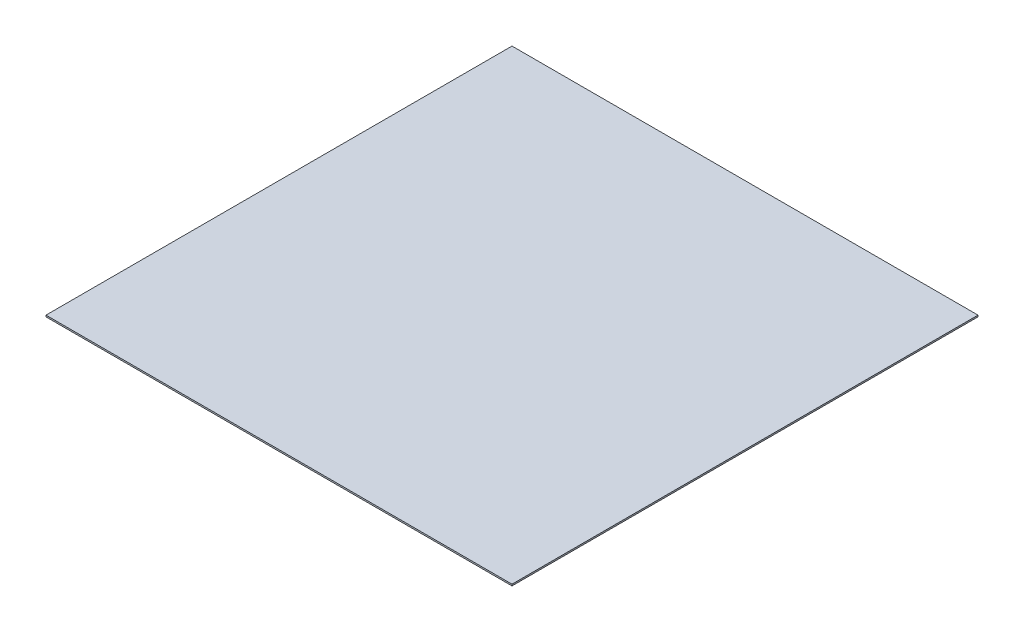
ISO-10303-21;
HEADER;
FILE_DESCRIPTION(('STEP AP214'),'2;1');
FILE_NAME('part.step','',(''),(''),'','','');
FILE_SCHEMA(('AUTOMOTIVE_DESIGN { 1 0 10303 214 1 1 1 1 }'));
ENDSEC;
DATA;
#1=APPLICATION_CONTEXT('core data for automotive mechanical design processes');
#2=APPLICATION_PROTOCOL_DEFINITION('international standard','automotive_design',2000,#1);
#3=PRODUCT_CONTEXT('',#1,'mechanical');
#4=PRODUCT('Part','Part','',(#3));
#5=PRODUCT_RELATED_PRODUCT_CATEGORY('part','',(#4));
#6=PRODUCT_DEFINITION_FORMATION('','',#4);
#7=PRODUCT_DEFINITION_CONTEXT('part definition',#1,'design');
#8=PRODUCT_DEFINITION('design','',#6,#7);
#9=PRODUCT_DEFINITION_SHAPE('','',#8);
#10=(LENGTH_UNIT() NAMED_UNIT(*) SI_UNIT(.MILLI.,.METRE.));
#11=(NAMED_UNIT(*) PLANE_ANGLE_UNIT() SI_UNIT($,.RADIAN.));
#12=(NAMED_UNIT(*) SI_UNIT($,.STERADIAN.) SOLID_ANGLE_UNIT());
#13=UNCERTAINTY_MEASURE_WITH_UNIT(LENGTH_MEASURE(1.E-05),#10,'distance_accuracy_value','');
#14=(GEOMETRIC_REPRESENTATION_CONTEXT(3) GLOBAL_UNCERTAINTY_ASSIGNED_CONTEXT((#13)) GLOBAL_UNIT_ASSIGNED_CONTEXT((#10,
#11,#12)) REPRESENTATION_CONTEXT('',''));
#15=CARTESIAN_POINT('',(0.,0.,0.));
#16=DIRECTION('',(0.,0.,1.));
#17=DIRECTION('',(1.,0.,0.));
#18=AXIS2_PLACEMENT_3D('',#15,#16,#17);
#19=CARTESIAN_POINT('',(1500.,10.,1500.));
#20=DIRECTION('',(-1.,0.,0.));
#21=DIRECTION('',(0.,0.,1.));
#22=AXIS2_PLACEMENT_3D('',#19,#20,#21);
#23=PLANE('',#22);
#24=DIRECTION('',(0.,0.,-1.));
#25=VECTOR('',#24,1.);
#26=CARTESIAN_POINT('',(1500.,0.,1500.));
#27=LINE('',#26,#25);
#28=CARTESIAN_POINT('',(1500.,0.,1500.));
#29=VERTEX_POINT('',#28);
#30=CARTESIAN_POINT('',(1500.,0.,-1500.));
#31=VERTEX_POINT('',#30);
#32=EDGE_CURVE('E107',#29,#31,#27,.T.);
#33=ORIENTED_EDGE('',*,*,#32,.T.);
#34=DIRECTION('',(0.,-1.,0.));
#35=VECTOR('',#34,1.);
#36=CARTESIAN_POINT('',(1500.,10.,-1500.));
#37=LINE('',#36,#35);
#38=CARTESIAN_POINT('',(1500.,10.,-1500.));
#39=VERTEX_POINT('',#38);
#40=EDGE_CURVE('E11',#39,#31,#37,.T.);
#41=ORIENTED_EDGE('',*,*,#40,.F.);
#42=DIRECTION('',(0.,0.,-1.));
#43=VECTOR('',#42,1.);
#44=CARTESIAN_POINT('',(1500.,10.,1500.));
#45=LINE('',#44,#43);
#46=CARTESIAN_POINT('',(1500.,10.,1500.));
#47=VERTEX_POINT('',#46);
#48=EDGE_CURVE('E91',#47,#39,#45,.T.);
#49=ORIENTED_EDGE('',*,*,#48,.F.);
#50=DIRECTION('',(0.,-1.,0.));
#51=VECTOR('',#50,1.);
#52=CARTESIAN_POINT('',(1500.,10.,1500.));
#53=LINE('',#52,#51);
#54=EDGE_CURVE('E103',#47,#29,#53,.T.);
#55=ORIENTED_EDGE('',*,*,#54,.T.);
#56=EDGE_LOOP('',(#33,#41,#49,#55));
#57=FACE_BOUND('',#56,.T.);
#58=ADVANCED_FACE('F39',(#57),#23,.F.);
#59=CARTESIAN_POINT('',(-1500.,10.,-1500.));
#60=DIRECTION('',(0.,0.,1.));
#61=DIRECTION('',(1.,0.,0.));
#62=AXIS2_PLACEMENT_3D('',#59,#60,#61);
#63=PLANE('',#62);
#64=DIRECTION('',(-1.,0.,0.));
#65=VECTOR('',#64,1.);
#66=CARTESIAN_POINT('',(-1500.,0.,-1500.));
#67=LINE('',#66,#65);
#68=CARTESIAN_POINT('',(-1500.,0.,-1500.));
#69=VERTEX_POINT('',#68);
#70=EDGE_CURVE('E96',#31,#69,#67,.T.);
#71=ORIENTED_EDGE('',*,*,#70,.T.);
#72=DIRECTION('',(0.,-1.,0.));
#73=VECTOR('',#72,1.);
#74=CARTESIAN_POINT('',(-1500.,10.,-1500.));
#75=LINE('',#74,#73);
#76=CARTESIAN_POINT('',(-1500.,10.,-1500.));
#77=VERTEX_POINT('',#76);
#78=EDGE_CURVE('E48',#77,#69,#75,.T.);
#79=ORIENTED_EDGE('',*,*,#78,.F.);
#80=DIRECTION('',(-1.,0.,0.));
#81=VECTOR('',#80,1.);
#82=CARTESIAN_POINT('',(-1500.,10.,-1500.));
#83=LINE('',#82,#81);
#84=EDGE_CURVE('E86',#39,#77,#83,.T.);
#85=ORIENTED_EDGE('',*,*,#84,.F.);
#86=ORIENTED_EDGE('',*,*,#40,.T.);
#87=EDGE_LOOP('',(#71,#79,#85,#86));
#88=FACE_BOUND('',#87,.T.);
#89=ADVANCED_FACE('F95',(#88),#63,.F.);
#90=CARTESIAN_POINT('',(-1500.,10.,1500.));
#91=DIRECTION('',(1.,0.,0.));
#92=DIRECTION('',(0.,0.,-1.));
#93=AXIS2_PLACEMENT_3D('',#90,#91,#92);
#94=PLANE('',#93);
#95=DIRECTION('',(0.,0.,1.));
#96=VECTOR('',#95,1.);
#97=CARTESIAN_POINT('',(-1500.,0.,1500.));
#98=LINE('',#97,#96);
#99=CARTESIAN_POINT('',(-1500.,0.,1500.));
#100=VERTEX_POINT('',#99);
#101=EDGE_CURVE('E73',#69,#100,#98,.T.);
#102=ORIENTED_EDGE('',*,*,#101,.T.);
#103=DIRECTION('',(0.,-1.,0.));
#104=VECTOR('',#103,1.);
#105=CARTESIAN_POINT('',(-1500.,10.,1500.));
#106=LINE('',#105,#104);
#107=CARTESIAN_POINT('',(-1500.,10.,1500.));
#108=VERTEX_POINT('',#107);
#109=EDGE_CURVE('E98',#108,#100,#106,.T.);
#110=ORIENTED_EDGE('',*,*,#109,.F.);
#111=DIRECTION('',(0.,0.,1.));
#112=VECTOR('',#111,1.);
#113=CARTESIAN_POINT('',(-1500.,10.,1500.));
#114=LINE('',#113,#112);
#115=EDGE_CURVE('E89',#77,#108,#114,.T.);
#116=ORIENTED_EDGE('',*,*,#115,.F.);
#117=ORIENTED_EDGE('',*,*,#78,.T.);
#118=EDGE_LOOP('',(#102,#110,#116,#117));
#119=FACE_BOUND('',#118,.T.);
#120=ADVANCED_FACE('F99',(#119),#94,.F.);
#121=CARTESIAN_POINT('',(-1500.,10.,1500.));
#122=DIRECTION('',(0.,0.,-1.));
#123=DIRECTION('',(-1.,0.,0.));
#124=AXIS2_PLACEMENT_3D('',#121,#122,#123);
#125=PLANE('',#124);
#126=DIRECTION('',(1.,0.,0.));
#127=VECTOR('',#126,1.);
#128=CARTESIAN_POINT('',(-1500.,0.,1500.));
#129=LINE('',#128,#127);
#130=EDGE_CURVE('E79',#100,#29,#129,.T.);
#131=ORIENTED_EDGE('',*,*,#130,.T.);
#132=ORIENTED_EDGE('',*,*,#54,.F.);
#133=DIRECTION('',(1.,0.,0.));
#134=VECTOR('',#133,1.);
#135=CARTESIAN_POINT('',(-1500.,10.,1500.));
#136=LINE('',#135,#134);
#137=EDGE_CURVE('E56',#108,#47,#136,.T.);
#138=ORIENTED_EDGE('',*,*,#137,.F.);
#139=ORIENTED_EDGE('',*,*,#109,.T.);
#140=EDGE_LOOP('',(#131,#132,#138,#139));
#141=FACE_BOUND('',#140,.T.);
#142=ADVANCED_FACE('F120',(#141),#125,.F.);
#143=CARTESIAN_POINT('',(0.,10.,0.));
#144=DIRECTION('',(0.,-1.,0.));
#145=DIRECTION('',(0.,0.,-1.));
#146=AXIS2_PLACEMENT_3D('',#143,#144,#145);
#147=PLANE('',#146);
#148=ORIENTED_EDGE('',*,*,#48,.T.);
#149=ORIENTED_EDGE('',*,*,#84,.T.);
#150=ORIENTED_EDGE('',*,*,#115,.T.);
#151=ORIENTED_EDGE('',*,*,#137,.T.);
#152=EDGE_LOOP('',(#148,#149,#150,#151));
#153=FACE_BOUND('',#152,.T.);
#154=ADVANCED_FACE('F87',(#153),#147,.F.);
#155=CARTESIAN_POINT('',(0.,0.,0.));
#156=DIRECTION('',(0.,-1.,0.));
#157=DIRECTION('',(0.,0.,-1.));
#158=AXIS2_PLACEMENT_3D('',#155,#156,#157);
#159=PLANE('',#158);
#160=ORIENTED_EDGE('',*,*,#32,.F.);
#161=ORIENTED_EDGE('',*,*,#130,.F.);
#162=ORIENTED_EDGE('',*,*,#101,.F.);
#163=ORIENTED_EDGE('',*,*,#70,.F.);
#164=EDGE_LOOP('',(#160,#161,#162,#163));
#165=FACE_BOUND('',#164,.T.);
#166=ADVANCED_FACE('F123',(#165),#159,.T.);
#167=CLOSED_SHELL('',(#58,#89,#120,#142,#154,#166));
#168=MANIFOLD_SOLID_BREP('B2',#167);
#169=ADVANCED_BREP_SHAPE_REPRESENTATION('',(#18,#168),#14);
#170=SHAPE_DEFINITION_REPRESENTATION(#9,#169);
ENDSEC;
END-ISO-10303-21;
